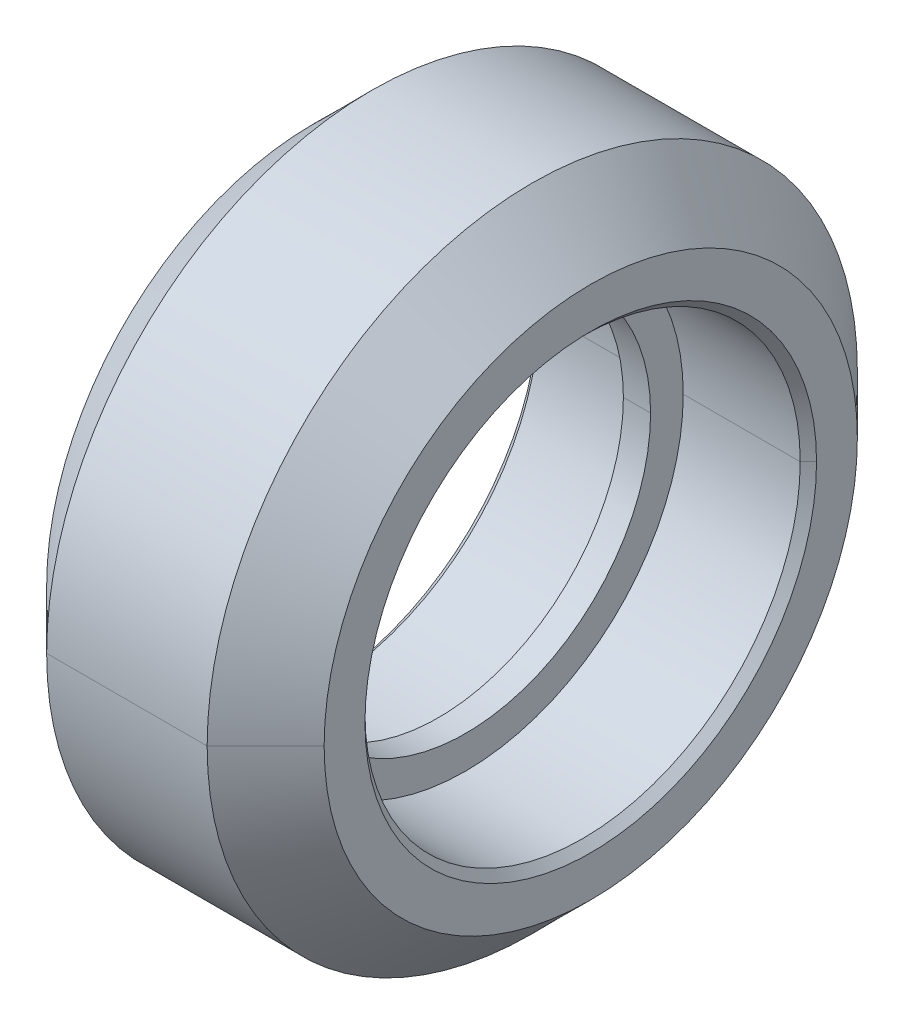
ISO-10303-21;
HEADER;
FILE_DESCRIPTION(('STEP AP214'),'2;1');
FILE_NAME('part.step','',(''),(''),'','','');
FILE_SCHEMA(('AUTOMOTIVE_DESIGN { 1 0 10303 214 1 1 1 1 }'));
ENDSEC;
DATA;
#1=APPLICATION_CONTEXT('core data for automotive mechanical design processes');
#2=APPLICATION_PROTOCOL_DEFINITION('international standard','automotive_design',2000,#1);
#3=PRODUCT_CONTEXT('',#1,'mechanical');
#4=PRODUCT('Part','Part','',(#3));
#5=PRODUCT_RELATED_PRODUCT_CATEGORY('part','',(#4));
#6=PRODUCT_DEFINITION_FORMATION('','',#4);
#7=PRODUCT_DEFINITION_CONTEXT('part definition',#1,'design');
#8=PRODUCT_DEFINITION('design','',#6,#7);
#9=PRODUCT_DEFINITION_SHAPE('','',#8);
#10=(LENGTH_UNIT() NAMED_UNIT(*) SI_UNIT(.MILLI.,.METRE.));
#11=(NAMED_UNIT(*) PLANE_ANGLE_UNIT() SI_UNIT($,.RADIAN.));
#12=(NAMED_UNIT(*) SI_UNIT($,.STERADIAN.) SOLID_ANGLE_UNIT());
#13=UNCERTAINTY_MEASURE_WITH_UNIT(LENGTH_MEASURE(1.E-05),#10,'distance_accuracy_value','');
#14=(GEOMETRIC_REPRESENTATION_CONTEXT(3) GLOBAL_UNCERTAINTY_ASSIGNED_CONTEXT((#13)) GLOBAL_UNIT_ASSIGNED_CONTEXT((#10,
#11,#12)) REPRESENTATION_CONTEXT('',''));
#15=CARTESIAN_POINT('',(0.,0.,0.));
#16=DIRECTION('',(0.,0.,1.));
#17=DIRECTION('',(1.,0.,0.));
#18=AXIS2_PLACEMENT_3D('',#15,#16,#17);
#19=CARTESIAN_POINT('',(-4.8,0.,0.));
#20=DIRECTION('',(-1.,0.,0.));
#21=DIRECTION('',(0.,0.,1.));
#22=AXIS2_PLACEMENT_3D('',#19,#20,#21);
#23=CONICAL_SURFACE('',#22,8.,0.785398163397442);
#24=DIRECTION('',(-0.707106781186552,0.,-0.707106781186544));
#25=VECTOR('',#24,1.);
#26=CARTESIAN_POINT('',(-4.8,0.,-8.));
#27=LINE('',#26,#25);
#28=CARTESIAN_POINT('',(-4.8,0.,-8.));
#29=VERTEX_POINT('',#28);
#30=CARTESIAN_POINT('',(-5.1,0.,-8.3));
#31=VERTEX_POINT('',#30);
#32=EDGE_CURVE('E299',#29,#31,#27,.T.);
#33=ORIENTED_EDGE('',*,*,#32,.F.);
#34=CARTESIAN_POINT('',(-4.8,0.,0.));
#35=DIRECTION('',(-1.,0.,0.));
#36=DIRECTION('',(0.,0.,-1.));
#37=AXIS2_PLACEMENT_3D('',#34,#35,#36);
#38=CIRCLE('',#37,8.);
#39=CARTESIAN_POINT('',(-4.8,0.,8.));
#40=VERTEX_POINT('',#39);
#41=EDGE_CURVE('E11',#40,#29,#38,.T.);
#42=ORIENTED_EDGE('',*,*,#41,.F.);
#43=DIRECTION('',(-0.707106781186552,0.,0.707106781186544));
#44=VECTOR('',#43,1.);
#45=CARTESIAN_POINT('',(-4.8,0.,8.));
#46=LINE('',#45,#44);
#47=CARTESIAN_POINT('',(-5.1,0.,8.3));
#48=VERTEX_POINT('',#47);
#49=EDGE_CURVE('E314',#40,#48,#46,.T.);
#50=ORIENTED_EDGE('',*,*,#49,.T.);
#51=CARTESIAN_POINT('',(-5.1,0.,0.));
#52=DIRECTION('',(1.,0.,0.));
#53=DIRECTION('',(0.,0.,-1.));
#54=AXIS2_PLACEMENT_3D('',#51,#52,#53);
#55=CIRCLE('',#54,8.3);
#56=EDGE_CURVE('E157',#31,#48,#55,.T.);
#57=ORIENTED_EDGE('',*,*,#56,.F.);
#58=EDGE_LOOP('',(#33,#42,#50,#57));
#59=FACE_BOUND('',#58,.T.);
#60=ADVANCED_FACE('F17',(#59),#23,.F.);
#61=CARTESIAN_POINT('',(4.8,0.,0.));
#62=DIRECTION('',(1.,0.,0.));
#63=DIRECTION('',(0.,0.,-1.));
#64=AXIS2_PLACEMENT_3D('',#61,#62,#63);
#65=CONICAL_SURFACE('',#64,8.,0.785398163397442);
#66=DIRECTION('',(0.707106781186552,0.,0.707106781186544));
#67=VECTOR('',#66,1.);
#68=CARTESIAN_POINT('',(4.8,0.,8.));
#69=LINE('',#68,#67);
#70=CARTESIAN_POINT('',(4.8,0.,8.));
#71=VERTEX_POINT('',#70);
#72=CARTESIAN_POINT('',(5.1,0.,8.3));
#73=VERTEX_POINT('',#72);
#74=EDGE_CURVE('E259',#71,#73,#69,.T.);
#75=ORIENTED_EDGE('',*,*,#74,.F.);
#76=CARTESIAN_POINT('',(4.8,0.,0.));
#77=DIRECTION('',(1.,0.,0.));
#78=DIRECTION('',(0.,0.,-1.));
#79=AXIS2_PLACEMENT_3D('',#76,#77,#78);
#80=CIRCLE('',#79,8.);
#81=CARTESIAN_POINT('',(4.8,0.,-8.));
#82=VERTEX_POINT('',#81);
#83=EDGE_CURVE('E164',#82,#71,#80,.T.);
#84=ORIENTED_EDGE('',*,*,#83,.F.);
#85=DIRECTION('',(0.707106781186552,0.,-0.707106781186544));
#86=VECTOR('',#85,1.);
#87=CARTESIAN_POINT('',(4.8,0.,-8.));
#88=LINE('',#87,#86);
#89=CARTESIAN_POINT('',(5.1,0.,-8.3));
#90=VERTEX_POINT('',#89);
#91=EDGE_CURVE('E263',#82,#90,#88,.T.);
#92=ORIENTED_EDGE('',*,*,#91,.T.);
#93=CARTESIAN_POINT('',(5.1,0.,0.));
#94=DIRECTION('',(-1.,0.,0.));
#95=DIRECTION('',(0.,0.,-1.));
#96=AXIS2_PLACEMENT_3D('',#93,#94,#95);
#97=CIRCLE('',#96,8.3);
#98=EDGE_CURVE('E151',#73,#90,#97,.T.);
#99=ORIENTED_EDGE('',*,*,#98,.F.);
#100=EDGE_LOOP('',(#75,#84,#92,#99));
#101=FACE_BOUND('',#100,.T.);
#102=ADVANCED_FACE('F291',(#101),#65,.F.);
#103=CARTESIAN_POINT('',(-2.95,0.,0.));
#104=DIRECTION('',(1.,0.,0.));
#105=DIRECTION('',(0.,0.,-1.));
#106=AXIS2_PLACEMENT_3D('',#103,#104,#105);
#107=CONICAL_SURFACE('',#106,11.95,0.785398163397449);
#108=DIRECTION('',(0.707106781186547,0.,0.707106781186548));
#109=VECTOR('',#108,1.);
#110=CARTESIAN_POINT('',(-2.95,0.,11.95));
#111=LINE('',#110,#109);
#112=CARTESIAN_POINT('',(-5.1,0.,9.8));
#113=VERTEX_POINT('',#112);
#114=CARTESIAN_POINT('',(-2.95,0.,11.95));
#115=VERTEX_POINT('',#114);
#116=EDGE_CURVE('E250',#113,#115,#111,.T.);
#117=ORIENTED_EDGE('',*,*,#116,.F.);
#118=CARTESIAN_POINT('',(-5.1,0.,0.));
#119=DIRECTION('',(-1.,0.,0.));
#120=DIRECTION('',(0.,0.,-1.));
#121=AXIS2_PLACEMENT_3D('',#118,#119,#120);
#122=CIRCLE('',#121,9.8);
#123=CARTESIAN_POINT('',(-5.1,0.,-9.8));
#124=VERTEX_POINT('',#123);
#125=EDGE_CURVE('E154',#124,#113,#122,.T.);
#126=ORIENTED_EDGE('',*,*,#125,.F.);
#127=DIRECTION('',(0.707106781186547,0.,-0.707106781186548));
#128=VECTOR('',#127,1.);
#129=CARTESIAN_POINT('',(-2.95,0.,-11.95));
#130=LINE('',#129,#128);
#131=CARTESIAN_POINT('',(-2.95,0.,-11.95));
#132=VERTEX_POINT('',#131);
#133=EDGE_CURVE('E240',#124,#132,#130,.T.);
#134=ORIENTED_EDGE('',*,*,#133,.T.);
#135=CARTESIAN_POINT('',(-2.95,0.,0.));
#136=DIRECTION('',(1.,0.,0.));
#137=DIRECTION('',(0.,0.,-1.));
#138=AXIS2_PLACEMENT_3D('',#135,#136,#137);
#139=CIRCLE('',#138,11.95);
#140=EDGE_CURVE('E150',#115,#132,#139,.T.);
#141=ORIENTED_EDGE('',*,*,#140,.F.);
#142=EDGE_LOOP('',(#117,#126,#134,#141));
#143=FACE_BOUND('',#142,.T.);
#144=ADVANCED_FACE('F242',(#143),#107,.T.);
#145=CARTESIAN_POINT('',(5.1,0.,0.));
#146=DIRECTION('',(-1.,0.,0.));
#147=DIRECTION('',(0.,0.,1.));
#148=AXIS2_PLACEMENT_3D('',#145,#146,#147);
#149=CONICAL_SURFACE('',#148,9.8,0.785398163397448);
#150=DIRECTION('',(-0.707106781186548,0.,-0.707106781186547));
#151=VECTOR('',#150,1.);
#152=CARTESIAN_POINT('',(5.1,0.,-9.8));
#153=LINE('',#152,#151);
#154=CARTESIAN_POINT('',(5.1,0.,-9.8));
#155=VERTEX_POINT('',#154);
#156=CARTESIAN_POINT('',(2.95,0.,-11.95));
#157=VERTEX_POINT('',#156);
#158=EDGE_CURVE('E200',#155,#157,#153,.T.);
#159=ORIENTED_EDGE('',*,*,#158,.F.);
#160=CARTESIAN_POINT('',(5.1,0.,0.));
#161=DIRECTION('',(1.,0.,0.));
#162=DIRECTION('',(0.,0.,-1.));
#163=AXIS2_PLACEMENT_3D('',#160,#161,#162);
#164=CIRCLE('',#163,9.8);
#165=CARTESIAN_POINT('',(5.1,0.,9.8));
#166=VERTEX_POINT('',#165);
#167=EDGE_CURVE('E145',#166,#155,#164,.T.);
#168=ORIENTED_EDGE('',*,*,#167,.F.);
#169=DIRECTION('',(-0.707106781186548,0.,0.707106781186547));
#170=VECTOR('',#169,1.);
#171=CARTESIAN_POINT('',(5.1,0.,9.8));
#172=LINE('',#171,#170);
#173=CARTESIAN_POINT('',(2.95,0.,11.95));
#174=VERTEX_POINT('',#173);
#175=EDGE_CURVE('E191',#166,#174,#172,.T.);
#176=ORIENTED_EDGE('',*,*,#175,.T.);
#177=CARTESIAN_POINT('',(2.95,0.,0.));
#178=DIRECTION('',(-1.,0.,0.));
#179=DIRECTION('',(0.,0.,-1.));
#180=AXIS2_PLACEMENT_3D('',#177,#178,#179);
#181=CIRCLE('',#180,11.95);
#182=EDGE_CURVE('E146',#157,#174,#181,.T.);
#183=ORIENTED_EDGE('',*,*,#182,.F.);
#184=EDGE_LOOP('',(#159,#168,#176,#183));
#185=FACE_BOUND('',#184,.T.);
#186=ADVANCED_FACE('F376',(#185),#149,.T.);
#187=CARTESIAN_POINT('',(-0.5,0.,0.));
#188=DIRECTION('',(-1.,0.,0.));
#189=DIRECTION('',(0.,0.,1.));
#190=AXIS2_PLACEMENT_3D('',#187,#188,#189);
#191=PLANE('',#190);
#192=CARTESIAN_POINT('',(-0.5,0.,0.));
#193=DIRECTION('',(-1.,0.,0.));
#194=DIRECTION('',(0.,0.,1.));
#195=AXIS2_PLACEMENT_3D('',#192,#193,#194);
#196=CIRCLE('',#195,6.8);
#197=CARTESIAN_POINT('',(-0.5,0.,6.8));
#198=VERTEX_POINT('',#197);
#199=CARTESIAN_POINT('',(-0.5,0.,-6.8));
#200=VERTEX_POINT('',#199);
#201=EDGE_CURVE('E37',#198,#200,#196,.T.);
#202=ORIENTED_EDGE('',*,*,#201,.F.);
#203=CARTESIAN_POINT('',(-0.5,0.,0.));
#204=DIRECTION('',(-1.,0.,0.));
#205=DIRECTION('',(0.,0.,1.));
#206=AXIS2_PLACEMENT_3D('',#203,#204,#205);
#207=CIRCLE('',#206,6.8);
#208=EDGE_CURVE('E124',#200,#198,#207,.T.);
#209=ORIENTED_EDGE('',*,*,#208,.F.);
#210=EDGE_LOOP('',(#202,#209));
#211=FACE_BOUND('',#210,.T.);
#212=CARTESIAN_POINT('',(-0.5,0.,0.));
#213=DIRECTION('',(-1.,0.,0.));
#214=DIRECTION('',(0.,0.,1.));
#215=AXIS2_PLACEMENT_3D('',#212,#213,#214);
#216=CIRCLE('',#215,8.);
#217=CARTESIAN_POINT('',(-0.5,0.,8.));
#218=VERTEX_POINT('',#217);
#219=CARTESIAN_POINT('',(-0.5,0.,-8.));
#220=VERTEX_POINT('',#219);
#221=EDGE_CURVE('E25',#218,#220,#216,.T.);
#222=ORIENTED_EDGE('',*,*,#221,.T.);
#223=CARTESIAN_POINT('',(-0.5,0.,0.));
#224=DIRECTION('',(-1.,0.,0.));
#225=DIRECTION('',(0.,0.,1.));
#226=AXIS2_PLACEMENT_3D('',#223,#224,#225);
#227=CIRCLE('',#226,8.);
#228=EDGE_CURVE('E174',#220,#218,#227,.T.);
#229=ORIENTED_EDGE('',*,*,#228,.T.);
#230=EDGE_LOOP('',(#222,#229));
#231=FACE_BOUND('',#230,.T.);
#232=ADVANCED_FACE('F172',(#211,#231),#191,.T.);
#233=CARTESIAN_POINT('',(-0.5,0.,0.));
#234=DIRECTION('',(-1.,0.,0.));
#235=DIRECTION('',(0.,0.,1.));
#236=AXIS2_PLACEMENT_3D('',#233,#234,#235);
#237=CYLINDRICAL_SURFACE('',#236,8.);
#238=DIRECTION('',(-1.,0.,0.));
#239=VECTOR('',#238,1.);
#240=CARTESIAN_POINT('',(-0.5,0.,-8.));
#241=LINE('',#240,#239);
#242=EDGE_CURVE('E179',#220,#29,#241,.T.);
#243=ORIENTED_EDGE('',*,*,#242,.F.);
#244=ORIENTED_EDGE('',*,*,#221,.F.);
#245=DIRECTION('',(-1.,0.,0.));
#246=VECTOR('',#245,1.);
#247=CARTESIAN_POINT('',(-0.5,0.,8.));
#248=LINE('',#247,#246);
#249=EDGE_CURVE('E187',#218,#40,#248,.T.);
#250=ORIENTED_EDGE('',*,*,#249,.T.);
#251=ORIENTED_EDGE('',*,*,#41,.T.);
#252=EDGE_LOOP('',(#243,#244,#250,#251));
#253=FACE_BOUND('',#252,.T.);
#254=ADVANCED_FACE('F180',(#253),#237,.F.);
#255=CARTESIAN_POINT('',(0.5,0.,0.));
#256=DIRECTION('',(1.,0.,0.));
#257=DIRECTION('',(0.,1.,0.));
#258=AXIS2_PLACEMENT_3D('',#255,#256,#257);
#259=PLANE('',#258);
#260=CARTESIAN_POINT('',(0.5,0.,0.));
#261=DIRECTION('',(1.,0.,0.));
#262=DIRECTION('',(0.,0.,-1.));
#263=AXIS2_PLACEMENT_3D('',#260,#261,#262);
#264=CIRCLE('',#263,6.8);
#265=CARTESIAN_POINT('',(0.5,0.,6.8));
#266=VERTEX_POINT('',#265);
#267=CARTESIAN_POINT('',(0.5,0.,-6.8));
#268=VERTEX_POINT('',#267);
#269=EDGE_CURVE('E123',#266,#268,#264,.T.);
#270=ORIENTED_EDGE('',*,*,#269,.F.);
#271=CARTESIAN_POINT('',(0.5,0.,0.));
#272=DIRECTION('',(1.,0.,0.));
#273=DIRECTION('',(0.,0.,-1.));
#274=AXIS2_PLACEMENT_3D('',#271,#272,#273);
#275=CIRCLE('',#274,6.8);
#276=EDGE_CURVE('E109',#268,#266,#275,.T.);
#277=ORIENTED_EDGE('',*,*,#276,.F.);
#278=EDGE_LOOP('',(#270,#277));
#279=FACE_BOUND('',#278,.T.);
#280=CARTESIAN_POINT('',(0.5,0.,0.));
#281=DIRECTION('',(1.,0.,0.));
#282=DIRECTION('',(0.,0.,-1.));
#283=AXIS2_PLACEMENT_3D('',#280,#281,#282);
#284=CIRCLE('',#283,8.);
#285=CARTESIAN_POINT('',(0.5,0.,-8.));
#286=VERTEX_POINT('',#285);
#287=CARTESIAN_POINT('',(0.5,0.,8.));
#288=VERTEX_POINT('',#287);
#289=EDGE_CURVE('E161',#286,#288,#284,.T.);
#290=ORIENTED_EDGE('',*,*,#289,.T.);
#291=CARTESIAN_POINT('',(0.5,0.,0.));
#292=DIRECTION('',(1.,0.,0.));
#293=DIRECTION('',(0.,0.,-1.));
#294=AXIS2_PLACEMENT_3D('',#291,#292,#293);
#295=CIRCLE('',#294,8.);
#296=EDGE_CURVE('E205',#288,#286,#295,.T.);
#297=ORIENTED_EDGE('',*,*,#296,.T.);
#298=EDGE_LOOP('',(#290,#297));
#299=FACE_BOUND('',#298,.T.);
#300=ADVANCED_FACE('F127',(#279,#299),#259,.T.);
#301=CARTESIAN_POINT('',(0.5,0.,0.));
#302=DIRECTION('',(1.,0.,0.));
#303=DIRECTION('',(0.,0.,-1.));
#304=AXIS2_PLACEMENT_3D('',#301,#302,#303);
#305=CYLINDRICAL_SURFACE('',#304,8.);
#306=DIRECTION('',(1.,0.,0.));
#307=VECTOR('',#306,1.);
#308=CARTESIAN_POINT('',(0.5,0.,8.));
#309=LINE('',#308,#307);
#310=EDGE_CURVE('E212',#288,#71,#309,.T.);
#311=ORIENTED_EDGE('',*,*,#310,.F.);
#312=ORIENTED_EDGE('',*,*,#289,.F.);
#313=DIRECTION('',(1.,0.,0.));
#314=VECTOR('',#313,1.);
#315=CARTESIAN_POINT('',(0.5,0.,-8.));
#316=LINE('',#315,#314);
#317=EDGE_CURVE('E216',#286,#82,#316,.T.);
#318=ORIENTED_EDGE('',*,*,#317,.T.);
#319=ORIENTED_EDGE('',*,*,#83,.T.);
#320=EDGE_LOOP('',(#311,#312,#318,#319));
#321=FACE_BOUND('',#320,.T.);
#322=ADVANCED_FACE('F275',(#321),#305,.F.);
#323=CARTESIAN_POINT('',(-5.1,0.,0.));
#324=DIRECTION('',(1.,0.,0.));
#325=DIRECTION('',(0.,1.,0.));
#326=AXIS2_PLACEMENT_3D('',#323,#324,#325);
#327=PLANE('',#326);
#328=CARTESIAN_POINT('',(-5.1,0.,0.));
#329=DIRECTION('',(1.,0.,0.));
#330=DIRECTION('',(0.,0.,-1.));
#331=AXIS2_PLACEMENT_3D('',#328,#329,#330);
#332=CIRCLE('',#331,8.3);
#333=EDGE_CURVE('E309',#48,#31,#332,.T.);
#334=ORIENTED_EDGE('',*,*,#333,.T.);
#335=ORIENTED_EDGE('',*,*,#56,.T.);
#336=EDGE_LOOP('',(#334,#335));
#337=FACE_BOUND('',#336,.T.);
#338=ORIENTED_EDGE('',*,*,#125,.T.);
#339=CARTESIAN_POINT('',(-5.1,0.,0.));
#340=DIRECTION('',(-1.,0.,0.));
#341=DIRECTION('',(0.,0.,-1.));
#342=AXIS2_PLACEMENT_3D('',#339,#340,#341);
#343=CIRCLE('',#342,9.8);
#344=EDGE_CURVE('E256',#113,#124,#343,.T.);
#345=ORIENTED_EDGE('',*,*,#344,.T.);
#346=EDGE_LOOP('',(#338,#345));
#347=FACE_BOUND('',#346,.T.);
#348=ADVANCED_FACE('F272',(#337,#347),#327,.F.);
#349=CARTESIAN_POINT('',(5.1,0.,0.));
#350=DIRECTION('',(-1.,0.,0.));
#351=DIRECTION('',(0.,0.,1.));
#352=AXIS2_PLACEMENT_3D('',#349,#350,#351);
#353=CYLINDRICAL_SURFACE('',#352,11.95);
#354=DIRECTION('',(-1.,0.,0.));
#355=VECTOR('',#354,1.);
#356=CARTESIAN_POINT('',(5.1,0.,-11.95));
#357=LINE('',#356,#355);
#358=EDGE_CURVE('E139',#157,#132,#357,.T.);
#359=ORIENTED_EDGE('',*,*,#358,.F.);
#360=ORIENTED_EDGE('',*,*,#182,.T.);
#361=DIRECTION('',(-1.,0.,0.));
#362=VECTOR('',#361,1.);
#363=CARTESIAN_POINT('',(5.1,0.,11.95));
#364=LINE('',#363,#362);
#365=EDGE_CURVE('E130',#174,#115,#364,.T.);
#366=ORIENTED_EDGE('',*,*,#365,.T.);
#367=ORIENTED_EDGE('',*,*,#140,.T.);
#368=EDGE_LOOP('',(#359,#360,#366,#367));
#369=FACE_BOUND('',#368,.T.);
#370=ADVANCED_FACE('F274',(#369),#353,.T.);
#371=CARTESIAN_POINT('',(5.1,0.,0.));
#372=DIRECTION('',(1.,0.,0.));
#373=DIRECTION('',(0.,1.,0.));
#374=AXIS2_PLACEMENT_3D('',#371,#372,#373);
#375=PLANE('',#374);
#376=CARTESIAN_POINT('',(5.1,0.,0.));
#377=DIRECTION('',(-1.,0.,0.));
#378=DIRECTION('',(0.,0.,-1.));
#379=AXIS2_PLACEMENT_3D('',#376,#377,#378);
#380=CIRCLE('',#379,8.3);
#381=EDGE_CURVE('E267',#90,#73,#380,.T.);
#382=ORIENTED_EDGE('',*,*,#381,.T.);
#383=ORIENTED_EDGE('',*,*,#98,.T.);
#384=EDGE_LOOP('',(#382,#383));
#385=FACE_BOUND('',#384,.T.);
#386=ORIENTED_EDGE('',*,*,#167,.T.);
#387=CARTESIAN_POINT('',(5.1,0.,0.));
#388=DIRECTION('',(1.,0.,0.));
#389=DIRECTION('',(0.,0.,-1.));
#390=AXIS2_PLACEMENT_3D('',#387,#388,#389);
#391=CIRCLE('',#390,9.8);
#392=EDGE_CURVE('E247',#155,#166,#391,.T.);
#393=ORIENTED_EDGE('',*,*,#392,.T.);
#394=EDGE_LOOP('',(#386,#393));
#395=FACE_BOUND('',#394,.T.);
#396=ADVANCED_FACE('F283',(#385,#395),#375,.T.);
#397=CARTESIAN_POINT('',(5.1,0.,0.));
#398=DIRECTION('',(-1.,0.,0.));
#399=DIRECTION('',(0.,0.,1.));
#400=AXIS2_PLACEMENT_3D('',#397,#398,#399);
#401=CYLINDRICAL_SURFACE('',#400,6.8);
#402=DIRECTION('',(-1.,0.,0.));
#403=VECTOR('',#402,1.);
#404=CARTESIAN_POINT('',(5.1,0.,-6.8));
#405=LINE('',#404,#403);
#406=EDGE_CURVE('E115',#268,#200,#405,.T.);
#407=ORIENTED_EDGE('',*,*,#406,.F.);
#408=ORIENTED_EDGE('',*,*,#276,.T.);
#409=DIRECTION('',(-1.,0.,0.));
#410=VECTOR('',#409,1.);
#411=CARTESIAN_POINT('',(5.1,0.,6.8));
#412=LINE('',#411,#410);
#413=EDGE_CURVE('E112',#266,#198,#412,.T.);
#414=ORIENTED_EDGE('',*,*,#413,.T.);
#415=ORIENTED_EDGE('',*,*,#201,.T.);
#416=EDGE_LOOP('',(#407,#408,#414,#415));
#417=FACE_BOUND('',#416,.T.);
#418=ADVANCED_FACE('F111',(#417),#401,.F.);
#419=CARTESIAN_POINT('',(5.1,0.,0.));
#420=DIRECTION('',(-1.,0.,0.));
#421=DIRECTION('',(0.,0.,1.));
#422=AXIS2_PLACEMENT_3D('',#419,#420,#421);
#423=CYLINDRICAL_SURFACE('',#422,6.8);
#424=ORIENTED_EDGE('',*,*,#269,.T.);
#425=ORIENTED_EDGE('',*,*,#406,.T.);
#426=ORIENTED_EDGE('',*,*,#208,.T.);
#427=ORIENTED_EDGE('',*,*,#413,.F.);
#428=EDGE_LOOP('',(#424,#425,#426,#427));
#429=FACE_BOUND('',#428,.T.);
#430=ADVANCED_FACE('F122',(#429),#423,.F.);
#431=CARTESIAN_POINT('',(5.1,0.,0.));
#432=DIRECTION('',(-1.,0.,0.));
#433=DIRECTION('',(0.,0.,1.));
#434=AXIS2_PLACEMENT_3D('',#431,#432,#433);
#435=CYLINDRICAL_SURFACE('',#434,11.95);
#436=CARTESIAN_POINT('',(2.95,0.,0.));
#437=DIRECTION('',(-1.,0.,0.));
#438=DIRECTION('',(0.,0.,-1.));
#439=AXIS2_PLACEMENT_3D('',#436,#437,#438);
#440=CIRCLE('',#439,11.95);
#441=EDGE_CURVE('E197',#174,#157,#440,.T.);
#442=ORIENTED_EDGE('',*,*,#441,.T.);
#443=ORIENTED_EDGE('',*,*,#358,.T.);
#444=CARTESIAN_POINT('',(-2.95,0.,0.));
#445=DIRECTION('',(1.,0.,0.));
#446=DIRECTION('',(0.,0.,-1.));
#447=AXIS2_PLACEMENT_3D('',#444,#445,#446);
#448=CIRCLE('',#447,11.95);
#449=EDGE_CURVE('E233',#132,#115,#448,.T.);
#450=ORIENTED_EDGE('',*,*,#449,.T.);
#451=ORIENTED_EDGE('',*,*,#365,.F.);
#452=EDGE_LOOP('',(#442,#443,#450,#451));
#453=FACE_BOUND('',#452,.T.);
#454=ADVANCED_FACE('F230',(#453),#435,.T.);
#455=CARTESIAN_POINT('',(0.5,0.,0.));
#456=DIRECTION('',(1.,0.,0.));
#457=DIRECTION('',(0.,0.,-1.));
#458=AXIS2_PLACEMENT_3D('',#455,#456,#457);
#459=CYLINDRICAL_SURFACE('',#458,8.);
#460=ORIENTED_EDGE('',*,*,#296,.F.);
#461=ORIENTED_EDGE('',*,*,#310,.T.);
#462=CARTESIAN_POINT('',(4.8,0.,0.));
#463=DIRECTION('',(1.,0.,0.));
#464=DIRECTION('',(0.,0.,-1.));
#465=AXIS2_PLACEMENT_3D('',#462,#463,#464);
#466=CIRCLE('',#465,8.);
#467=EDGE_CURVE('E323',#71,#82,#466,.T.);
#468=ORIENTED_EDGE('',*,*,#467,.T.);
#469=ORIENTED_EDGE('',*,*,#317,.F.);
#470=EDGE_LOOP('',(#460,#461,#468,#469));
#471=FACE_BOUND('',#470,.T.);
#472=ADVANCED_FACE('F365',(#471),#459,.F.);
#473=CARTESIAN_POINT('',(-0.5,0.,0.));
#474=DIRECTION('',(-1.,0.,0.));
#475=DIRECTION('',(0.,0.,1.));
#476=AXIS2_PLACEMENT_3D('',#473,#474,#475);
#477=CYLINDRICAL_SURFACE('',#476,8.);
#478=ORIENTED_EDGE('',*,*,#228,.F.);
#479=ORIENTED_EDGE('',*,*,#242,.T.);
#480=CARTESIAN_POINT('',(-4.8,0.,0.));
#481=DIRECTION('',(-1.,0.,0.));
#482=DIRECTION('',(0.,0.,-1.));
#483=AXIS2_PLACEMENT_3D('',#480,#481,#482);
#484=CIRCLE('',#483,8.);
#485=EDGE_CURVE('E310',#29,#40,#484,.T.);
#486=ORIENTED_EDGE('',*,*,#485,.T.);
#487=ORIENTED_EDGE('',*,*,#249,.F.);
#488=EDGE_LOOP('',(#478,#479,#486,#487));
#489=FACE_BOUND('',#488,.T.);
#490=ADVANCED_FACE('F189',(#489),#477,.F.);
#491=CARTESIAN_POINT('',(5.1,0.,0.));
#492=DIRECTION('',(-1.,0.,0.));
#493=DIRECTION('',(0.,0.,1.));
#494=AXIS2_PLACEMENT_3D('',#491,#492,#493);
#495=CONICAL_SURFACE('',#494,9.8,0.785398163397448);
#496=ORIENTED_EDGE('',*,*,#392,.F.);
#497=ORIENTED_EDGE('',*,*,#158,.T.);
#498=ORIENTED_EDGE('',*,*,#441,.F.);
#499=ORIENTED_EDGE('',*,*,#175,.F.);
#500=EDGE_LOOP('',(#496,#497,#498,#499));
#501=FACE_BOUND('',#500,.T.);
#502=ADVANCED_FACE('F485',(#501),#495,.T.);
#503=CARTESIAN_POINT('',(-2.95,0.,0.));
#504=DIRECTION('',(1.,0.,0.));
#505=DIRECTION('',(0.,0.,-1.));
#506=AXIS2_PLACEMENT_3D('',#503,#504,#505);
#507=CONICAL_SURFACE('',#506,11.95,0.785398163397449);
#508=ORIENTED_EDGE('',*,*,#344,.F.);
#509=ORIENTED_EDGE('',*,*,#116,.T.);
#510=ORIENTED_EDGE('',*,*,#449,.F.);
#511=ORIENTED_EDGE('',*,*,#133,.F.);
#512=EDGE_LOOP('',(#508,#509,#510,#511));
#513=FACE_BOUND('',#512,.T.);
#514=ADVANCED_FACE('F249',(#513),#507,.T.);
#515=CARTESIAN_POINT('',(4.8,0.,0.));
#516=DIRECTION('',(1.,0.,0.));
#517=DIRECTION('',(0.,0.,-1.));
#518=AXIS2_PLACEMENT_3D('',#515,#516,#517);
#519=CONICAL_SURFACE('',#518,8.,0.785398163397442);
#520=ORIENTED_EDGE('',*,*,#467,.F.);
#521=ORIENTED_EDGE('',*,*,#74,.T.);
#522=ORIENTED_EDGE('',*,*,#381,.F.);
#523=ORIENTED_EDGE('',*,*,#91,.F.);
#524=EDGE_LOOP('',(#520,#521,#522,#523));
#525=FACE_BOUND('',#524,.T.);
#526=ADVANCED_FACE('F364',(#525),#519,.F.);
#527=CARTESIAN_POINT('',(-4.8,0.,0.));
#528=DIRECTION('',(-1.,0.,0.));
#529=DIRECTION('',(0.,0.,1.));
#530=AXIS2_PLACEMENT_3D('',#527,#528,#529);
#531=CONICAL_SURFACE('',#530,8.,0.785398163397442);
#532=ORIENTED_EDGE('',*,*,#485,.F.);
#533=ORIENTED_EDGE('',*,*,#32,.T.);
#534=ORIENTED_EDGE('',*,*,#333,.F.);
#535=ORIENTED_EDGE('',*,*,#49,.F.);
#536=EDGE_LOOP('',(#532,#533,#534,#535));
#537=FACE_BOUND('',#536,.T.);
#538=ADVANCED_FACE('F313',(#537),#531,.F.);
#539=CLOSED_SHELL('',(#60,#102,#144,#186,#232,#254,#300,#322,#348,#370,#396,#418,#430,#454,#472,
#490,#502,#514,#526,#538));
#540=MANIFOLD_SOLID_BREP('B1',#539);
#541=ADVANCED_BREP_SHAPE_REPRESENTATION('',(#18,#540),#14);
#542=SHAPE_DEFINITION_REPRESENTATION(#9,#541);
ENDSEC;
END-ISO-10303-21;
